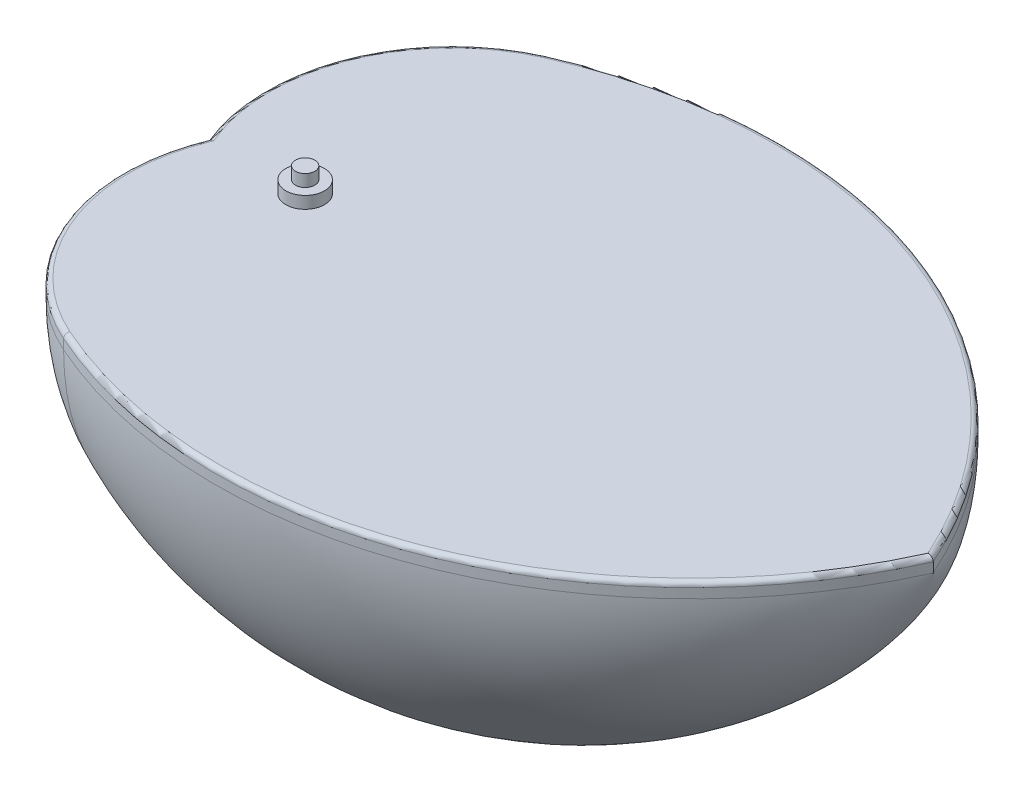
ISO-10303-21;
HEADER;
FILE_DESCRIPTION(('STEP AP214'),'2;1');
FILE_NAME('part.step','',(''),(''),'','','');
FILE_SCHEMA(('AUTOMOTIVE_DESIGN { 1 0 10303 214 1 1 1 1 }'));
ENDSEC;
DATA;
#1=APPLICATION_CONTEXT('core data for automotive mechanical design processes');
#2=APPLICATION_PROTOCOL_DEFINITION('international standard','automotive_design',2000,#1);
#3=PRODUCT_CONTEXT('',#1,'mechanical');
#4=PRODUCT('Part','Part','',(#3));
#5=PRODUCT_RELATED_PRODUCT_CATEGORY('part','',(#4));
#6=PRODUCT_DEFINITION_FORMATION('','',#4);
#7=PRODUCT_DEFINITION_CONTEXT('part definition',#1,'design');
#8=PRODUCT_DEFINITION('design','',#6,#7);
#9=PRODUCT_DEFINITION_SHAPE('','',#8);
#10=(LENGTH_UNIT() NAMED_UNIT(*) SI_UNIT(.MILLI.,.METRE.));
#11=(NAMED_UNIT(*) PLANE_ANGLE_UNIT() SI_UNIT($,.RADIAN.));
#12=(NAMED_UNIT(*) SI_UNIT($,.STERADIAN.) SOLID_ANGLE_UNIT());
#13=UNCERTAINTY_MEASURE_WITH_UNIT(LENGTH_MEASURE(1.E-05),#10,'distance_accuracy_value','');
#14=(GEOMETRIC_REPRESENTATION_CONTEXT(3) GLOBAL_UNCERTAINTY_ASSIGNED_CONTEXT((#13)) GLOBAL_UNIT_ASSIGNED_CONTEXT((#10,
#11,#12)) REPRESENTATION_CONTEXT('',''));
#15=CARTESIAN_POINT('',(0.,0.,0.));
#16=DIRECTION('',(0.,0.,1.));
#17=DIRECTION('',(1.,0.,0.));
#18=AXIS2_PLACEMENT_3D('',#15,#16,#17);
#19=CARTESIAN_POINT('',(15.6756756756759,53.,-14.7297297297297));
#20=DIRECTION('',(0.,-1.,0.));
#21=DIRECTION('',(0.,0.,-1.));
#22=AXIS2_PLACEMENT_3D('',#19,#20,#21);
#23=CYLINDRICAL_SURFACE('',#22,38.5968751692011);
#24=DIRECTION('',(0.,-1.,0.));
#25=VECTOR('',#24,1.);
#26=CARTESIAN_POINT('',(-20.,53.,0.));
#27=LINE('',#26,#25);
#28=CARTESIAN_POINT('',(-20.,52.,0.));
#29=VERTEX_POINT('',#28);
#30=CARTESIAN_POINT('',(-20.,50.,0.));
#31=VERTEX_POINT('',#30);
#32=EDGE_CURVE('E113',#29,#31,#27,.T.);
#33=ORIENTED_EDGE('',*,*,#32,.F.);
#34=CARTESIAN_POINT('',(15.6756756756759,52.,-14.7297297297297));
#35=DIRECTION('',(0.,1.,0.));
#36=DIRECTION('',(0.,0.,1.));
#37=AXIS2_PLACEMENT_3D('',#34,#35,#36);
#38=CIRCLE('',#37,38.5968751692011);
#39=CARTESIAN_POINT('',(0.,51.9999999999998,-50.));
#40=VERTEX_POINT('',#39);
#41=EDGE_CURVE('E57',#29,#40,#38,.F.);
#42=ORIENTED_EDGE('',*,*,#41,.T.);
#43=DIRECTION('',(0.,-1.,0.));
#44=VECTOR('',#43,1.);
#45=CARTESIAN_POINT('',(0.,52.9999999999998,-50.));
#46=LINE('',#45,#44);
#47=CARTESIAN_POINT('',(0.,49.9999999999998,-50.));
#48=VERTEX_POINT('',#47);
#49=EDGE_CURVE('E128',#40,#48,#46,.T.);
#50=ORIENTED_EDGE('',*,*,#49,.T.);
#51=CARTESIAN_POINT('',(15.6756756756759,50.,-14.7297297297296));
#52=DIRECTION('',(0.,-1.,0.));
#53=DIRECTION('',(1.,0.,0.));
#54=AXIS2_PLACEMENT_3D('',#51,#52,#53);
#55=CIRCLE('',#54,38.5968751692011);
#56=EDGE_CURVE('E126',#31,#48,#55,.T.);
#57=ORIENTED_EDGE('',*,*,#56,.F.);
#58=EDGE_LOOP('',(#33,#42,#50,#57));
#59=FACE_BOUND('',#58,.T.);
#60=ADVANCED_FACE('F46',(#59),#23,.T.);
#61=CARTESIAN_POINT('',(15.6756756756759,53.0000000000001,14.7297297297296));
#62=DIRECTION('',(0.,-1.,0.));
#63=DIRECTION('',(0.,0.,-1.));
#64=AXIS2_PLACEMENT_3D('',#61,#62,#63);
#65=CYLINDRICAL_SURFACE('',#64,38.5968751692011);
#66=DIRECTION('',(0.,-1.,0.));
#67=VECTOR('',#66,1.);
#68=CARTESIAN_POINT('',(0.,53.0000000000002,50.));
#69=LINE('',#68,#67);
#70=CARTESIAN_POINT('',(0.,52.0000000000002,50.));
#71=VERTEX_POINT('',#70);
#72=CARTESIAN_POINT('',(0.,50.0000000000002,50.));
#73=VERTEX_POINT('',#72);
#74=EDGE_CURVE('E123',#71,#73,#69,.T.);
#75=ORIENTED_EDGE('',*,*,#74,.F.);
#76=CARTESIAN_POINT('',(15.6756756756759,52.,14.7297297297296));
#77=DIRECTION('',(0.,1.,0.));
#78=DIRECTION('',(0.,0.,1.));
#79=AXIS2_PLACEMENT_3D('',#76,#77,#78);
#80=CIRCLE('',#79,38.5968751692011);
#81=EDGE_CURVE('E64',#71,#29,#80,.F.);
#82=ORIENTED_EDGE('',*,*,#81,.T.);
#83=ORIENTED_EDGE('',*,*,#32,.T.);
#84=CARTESIAN_POINT('',(15.6756756756759,50.0000000000001,14.7297297297296));
#85=DIRECTION('',(0.,1.,0.));
#86=DIRECTION('',(1.,0.,0.));
#87=AXIS2_PLACEMENT_3D('',#84,#85,#86);
#88=CIRCLE('',#87,38.5968751692011);
#89=EDGE_CURVE('E117',#31,#73,#88,.T.);
#90=ORIENTED_EDGE('',*,*,#89,.T.);
#91=EDGE_LOOP('',(#75,#82,#83,#90));
#92=FACE_BOUND('',#91,.T.);
#93=ADVANCED_FACE('F115',(#92),#65,.T.);
#94=CARTESIAN_POINT('',(40.0000000000002,52.9999999999999,-39.9999999999995));
#95=DIRECTION('',(0.,-1.,0.));
#96=DIRECTION('',(0.,0.,-1.));
#97=AXIS2_PLACEMENT_3D('',#94,#95,#96);
#98=CYLINDRICAL_SURFACE('',#97,98.4885780179606);
#99=DIRECTION('',(0.,-1.,0.));
#100=VECTOR('',#99,1.);
#101=CARTESIAN_POINT('',(130.,53.,0.));
#102=LINE('',#101,#100);
#103=CARTESIAN_POINT('',(130.,52.,0.));
#104=VERTEX_POINT('',#103);
#105=CARTESIAN_POINT('',(130.,50.,0.));
#106=VERTEX_POINT('',#105);
#107=EDGE_CURVE('E259',#104,#106,#102,.T.);
#108=ORIENTED_EDGE('',*,*,#107,.F.);
#109=CARTESIAN_POINT('',(40.0000000000002,51.9999999999999,-39.9999999999995));
#110=DIRECTION('',(0.,1.,0.));
#111=DIRECTION('',(0.,0.,1.));
#112=AXIS2_PLACEMENT_3D('',#109,#110,#111);
#113=CIRCLE('',#112,98.4885780179606);
#114=EDGE_CURVE('E72',#104,#71,#113,.F.);
#115=ORIENTED_EDGE('',*,*,#114,.T.);
#116=ORIENTED_EDGE('',*,*,#74,.T.);
#117=CARTESIAN_POINT('',(40.0000000000002,49.9999999999999,-39.9999999999995));
#118=DIRECTION('',(0.,1.,0.));
#119=DIRECTION('',(1.,0.,0.));
#120=AXIS2_PLACEMENT_3D('',#117,#118,#119);
#121=CIRCLE('',#120,98.4885780179606);
#122=EDGE_CURVE('E132',#73,#106,#121,.T.);
#123=ORIENTED_EDGE('',*,*,#122,.T.);
#124=EDGE_LOOP('',(#108,#115,#116,#123));
#125=FACE_BOUND('',#124,.T.);
#126=ADVANCED_FACE('F220',(#125),#98,.T.);
#127=CARTESIAN_POINT('',(40.0000000000002,53.0000000000001,39.9999999999994));
#128=DIRECTION('',(0.,-1.,0.));
#129=DIRECTION('',(0.,0.,-1.));
#130=AXIS2_PLACEMENT_3D('',#127,#128,#129);
#131=CYLINDRICAL_SURFACE('',#130,98.4885780179606);
#132=ORIENTED_EDGE('',*,*,#49,.F.);
#133=CARTESIAN_POINT('',(40.0000000000002,52.0000000000001,39.9999999999994));
#134=DIRECTION('',(0.,1.,0.));
#135=DIRECTION('',(0.,0.,1.));
#136=AXIS2_PLACEMENT_3D('',#133,#134,#135);
#137=CIRCLE('',#136,98.4885780179606);
#138=EDGE_CURVE('E166',#40,#104,#137,.F.);
#139=ORIENTED_EDGE('',*,*,#138,.T.);
#140=ORIENTED_EDGE('',*,*,#107,.T.);
#141=CARTESIAN_POINT('',(40.0000000000002,49.9999999999999,39.9999999999995));
#142=DIRECTION('',(0.,-1.,0.));
#143=DIRECTION('',(1.,0.,0.));
#144=AXIS2_PLACEMENT_3D('',#141,#142,#143);
#145=CIRCLE('',#144,98.4885780179606);
#146=EDGE_CURVE('E122',#48,#106,#145,.T.);
#147=ORIENTED_EDGE('',*,*,#146,.F.);
#148=EDGE_LOOP('',(#132,#139,#140,#147));
#149=FACE_BOUND('',#148,.T.);
#150=ADVANCED_FACE('F298',(#149),#131,.T.);
#151=CARTESIAN_POINT('',(15.6756756756759,53.,0.));
#152=DIRECTION('',(0.,1.,0.));
#153=DIRECTION('',(0.,0.,1.));
#154=AXIS2_PLACEMENT_3D('',#151,#152,#153);
#155=PLANE('',#154);
#156=CARTESIAN_POINT('',(0.,53.,0.));
#157=DIRECTION('',(0.,1.,0.));
#158=DIRECTION('',(0.,0.,1.));
#159=AXIS2_PLACEMENT_3D('',#156,#157,#158);
#160=CIRCLE('',#159,4.);
#161=CARTESIAN_POINT('',(0.,53.,3.99999999999999));
#162=VERTEX_POINT('',#161);
#163=EDGE_CURVE('E11',#162,#162,#160,.T.);
#164=ORIENTED_EDGE('',*,*,#163,.F.);
#165=EDGE_LOOP('',(#164));
#166=FACE_BOUND('',#165,.T.);
#167=CARTESIAN_POINT('',(40.0000000000002,52.9999999999999,-39.9999999999995));
#168=DIRECTION('',(0.,1.,0.));
#169=DIRECTION('',(0.,0.,1.));
#170=AXIS2_PLACEMENT_3D('',#167,#168,#169);
#171=CIRCLE('',#170,97.4885780179606);
#172=CARTESIAN_POINT('',(0.40613846605344,53.0000000000002,49.0861884513797));
#173=VERTEX_POINT('',#172);
#174=CARTESIAN_POINT('',(128.904571558295,53.,0.));
#175=VERTEX_POINT('',#174);
#176=EDGE_CURVE('E159',#173,#175,#171,.T.);
#177=ORIENTED_EDGE('',*,*,#176,.T.);
#178=CARTESIAN_POINT('',(40.0000000000002,53.0000000000001,39.9999999999994));
#179=DIRECTION('',(0.,1.,0.));
#180=DIRECTION('',(0.,0.,1.));
#181=AXIS2_PLACEMENT_3D('',#178,#179,#180);
#182=CIRCLE('',#181,97.4885780179606);
#183=CARTESIAN_POINT('',(0.406138466053471,52.9999999999998,-49.0861884513798));
#184=VERTEX_POINT('',#183);
#185=EDGE_CURVE('E162',#175,#184,#182,.T.);
#186=ORIENTED_EDGE('',*,*,#185,.T.);
#187=CARTESIAN_POINT('',(15.6756756756759,53.,-14.7297297297297));
#188=DIRECTION('',(0.,1.,0.));
#189=DIRECTION('',(0.,0.,1.));
#190=AXIS2_PLACEMENT_3D('',#187,#188,#189);
#191=CIRCLE('',#190,37.5968751692011);
#192=CARTESIAN_POINT('',(-18.9156539399606,53.,0.));
#193=VERTEX_POINT('',#192);
#194=EDGE_CURVE('E153',#184,#193,#191,.T.);
#195=ORIENTED_EDGE('',*,*,#194,.T.);
#196=CARTESIAN_POINT('',(15.6756756756759,53.0000000000001,14.7297297297296));
#197=DIRECTION('',(0.,1.,0.));
#198=DIRECTION('',(0.,0.,1.));
#199=AXIS2_PLACEMENT_3D('',#196,#197,#198);
#200=CIRCLE('',#199,37.5968751692011);
#201=EDGE_CURVE('E156',#193,#173,#200,.T.);
#202=ORIENTED_EDGE('',*,*,#201,.T.);
#203=EDGE_LOOP('',(#177,#186,#195,#202));
#204=FACE_BOUND('',#203,.T.);
#205=ADVANCED_FACE('F225',(#166,#204),#155,.T.);
#206=CARTESIAN_POINT('',(40.0000000000002,50.,39.9999999999995));
#207=DIRECTION('',(0.,-1.,0.));
#208=DIRECTION('',(0.,0.,-1.));
#209=AXIS2_PLACEMENT_3D('',#206,#207,#208);
#210=CIRCLE('',#209,98.4885780179606);
#211=TRIMMED_CURVE('',#210,(PARAMETER_VALUE(-1.15257199721567)),
(PARAMETER_VALUE(1.15257199721567)),.T.,.PARAMETER.);
#212=CARTESIAN_POINT('',(40.0000000000002,50.,0.));
#213=DIRECTION('',(1.,0.,0.));
#214=AXIS1_PLACEMENT('',#212,#213);
#215=SURFACE_OF_REVOLUTION('',#211,#214);
#216=ORIENTED_EDGE('',*,*,#146,.T.);
#217=ORIENTED_EDGE('',*,*,#122,.F.);
#218=CARTESIAN_POINT('',(0.,50.,0.));
#219=DIRECTION('',(1.,0.,0.));
#220=DIRECTION('',(0.,0.,-1.));
#221=AXIS2_PLACEMENT_3D('',#218,#219,#220);
#222=CIRCLE('',#221,50.);
#223=EDGE_CURVE('E137',#73,#48,#222,.T.);
#224=ORIENTED_EDGE('',*,*,#223,.T.);
#225=EDGE_LOOP('',(#216,#217,#224));
#226=FACE_BOUND('',#225,.T.);
#227=ADVANCED_FACE('F212',(#226),#215,.T.);
#228=CARTESIAN_POINT('',(15.6756756756759,50.,-14.7297297297296));
#229=DIRECTION('',(0.,-1.,0.));
#230=DIRECTION('',(0.,0.,-1.));
#231=AXIS2_PLACEMENT_3D('',#228,#229,#230);
#232=CIRCLE('',#231,38.5968751692011);
#233=TRIMMED_CURVE('',#232,(PARAMETER_VALUE(-1.96235556978583)),
(PARAMETER_VALUE(1.96235556978583)),.T.,.PARAMETER.);
#234=CARTESIAN_POINT('',(15.6756756756759,50.,0.));
#235=DIRECTION('',(1.,0.,0.));
#236=AXIS1_PLACEMENT('',#234,#235);
#237=SURFACE_OF_REVOLUTION('',#233,#236);
#238=ORIENTED_EDGE('',*,*,#89,.F.);
#239=ORIENTED_EDGE('',*,*,#56,.T.);
#240=ORIENTED_EDGE('',*,*,#223,.F.);
#241=EDGE_LOOP('',(#238,#239,#240));
#242=FACE_BOUND('',#241,.T.);
#243=ADVANCED_FACE('F135',(#242),#237,.T.);
#244=CARTESIAN_POINT('',(15.6756756756759,52.,14.7297297297296));
#245=DIRECTION('',(0.,1.,0.));
#246=DIRECTION('',(0.,0.,1.));
#247=AXIS2_PLACEMENT_3D('',#244,#245,#246);
#248=TOROIDAL_SURFACE('',#247,37.5968751692011,1.);
#249=CARTESIAN_POINT('',(-20.,52.,0.));
#250=CARTESIAN_POINT('',(-20.0000008942307,52.0265881981247,0.));
#251=CARTESIAN_POINT('',(-19.998851965732,52.0531630822867,0.));
#252=CARTESIAN_POINT('',(-19.9942757382792,52.106110709804,0.));
#253=CARTESIAN_POINT('',(-19.9908488928273,52.1324834923382,0.));
#254=CARTESIAN_POINT('',(-19.9772154187964,52.2108632711494,0.));
#255=CARTESIAN_POINT('',(-19.9636554984264,52.262325128727,0.));
#256=CARTESIAN_POINT('',(-19.9281336407968,52.3622047132036,0.));
#257=CARTESIAN_POINT('',(-19.9061738176468,52.4106232024982,0.));
#258=CARTESIAN_POINT('',(-19.8546681654547,52.5032534888218,0.));
#259=CARTESIAN_POINT('',(-19.825119583024,52.5474637510059,0.));
#260=CARTESIAN_POINT('',(-19.7584372603466,52.6319442369395,0.));
#261=CARTESIAN_POINT('',(-19.7210994483899,52.6720529195404,0.));
#262=CARTESIAN_POINT('',(-19.6406226546427,52.7459466810388,0.));
#263=CARTESIAN_POINT('',(-19.5974818451155,52.7797297595454,0.));
#264=CARTESIAN_POINT('',(-19.5033461416204,52.8425915319424,0.));
#265=CARTESIAN_POINT('',(-19.4520097056505,52.8711581761005,-1.77432944310521E-13));
#266=CARTESIAN_POINT('',(-19.3455037489036,52.9199489392985,1.79817796800386E-13));
#267=CARTESIAN_POINT('',(-19.29033278428,52.9401698957656,6.7599294229863E-13));
#268=CARTESIAN_POINT('',(-19.183406855448,52.970371105158,-5.80318881900574E-13));
#269=CARTESIAN_POINT('',(-19.1318852462507,52.9811915456213,-2.10648612234231E-12));
#270=CARTESIAN_POINT('',(-19.0279282565205,52.995821857923,2.1830662159427E-12));
#271=CARTESIAN_POINT('',(-18.9754949206272,52.9996457760884,7.98403603179329E-12));
#272=CARTESIAN_POINT('',(-18.9206196880964,52.9999921897505,7.33969878101688E-13));
#273=CARTESIAN_POINT('',(-18.9181367386374,53.0000000184385,3.77335158569541E-13));
#274=CARTESIAN_POINT('',(-18.9156539399606,53.,0.));
#275=B_SPLINE_CURVE_WITH_KNOTS('',3,(#249,#250,#251,#252,#253,#254,#255,#256,#257,#258,#259,
#260,#261,#262,#263,#264,#265,#266,#267,#268,#269,#270,#271,#272,#273,#274),.UNSPECIFIED.,.F.,
.F.,(4,2,2,2,2,2,2,2,2,2,2,2,4),(0.,0.079713634625249,0.159411404101059,0.31823432499261,
0.47701729918759,0.635857965340239,0.799549095224154,0.963291903213032,1.13879341601281,
1.31436137364606,1.47184816658384,1.62901843819876,1.6364672652337),.UNSPECIFIED.);
#276=EDGE_CURVE('E189',#29,#193,#275,.T.);
#277=ORIENTED_EDGE('',*,*,#276,.F.);
#278=ORIENTED_EDGE('',*,*,#81,.F.);
#279=CARTESIAN_POINT('',(0.406138466053441,52.0000000000002,49.0861884513797));
#280=DIRECTION('',(0.913811548620255,0.,0.406138466053452));
#281=DIRECTION('',(0.406138466053452,0.,-0.913811548620255));
#282=AXIS2_PLACEMENT_3D('',#279,#280,#281);
#283=CIRCLE('',#282,1.);
#284=EDGE_CURVE('E264',#173,#71,#283,.T.);
#285=ORIENTED_EDGE('',*,*,#284,.F.);
#286=ORIENTED_EDGE('',*,*,#201,.F.);
#287=EDGE_LOOP('',(#277,#278,#285,#286));
#288=FACE_BOUND('',#287,.T.);
#289=ADVANCED_FACE('F202',(#288),#248,.T.);
#290=CARTESIAN_POINT('',(40.0000000000002,51.9999999999999,-39.9999999999995));
#291=DIRECTION('',(0.,1.,0.));
#292=DIRECTION('',(0.,0.,1.));
#293=AXIS2_PLACEMENT_3D('',#290,#291,#292);
#294=TOROIDAL_SURFACE('',#293,97.4885780179606,1.);
#295=ORIENTED_EDGE('',*,*,#284,.T.);
#296=ORIENTED_EDGE('',*,*,#114,.F.);
#297=CARTESIAN_POINT('',(130.,52.,0.));
#298=CARTESIAN_POINT('',(130.000001063704,52.0263846918935,0.));
#299=CARTESIAN_POINT('',(129.99885646564,52.0527560680167,0.));
#300=CARTESIAN_POINT('',(129.994298653511,52.1052962087965,0.));
#301=CARTESIAN_POINT('',(129.990885946555,52.1314650174209,0.));
#302=CARTESIAN_POINT('',(129.97731413261,52.2092198167741,0.));
#303=CARTESIAN_POINT('',(129.963820924888,52.260261519649,0.));
#304=CARTESIAN_POINT('',(129.92850629502,52.3593116689709,0.));
#305=CARTESIAN_POINT('',(129.906687924555,52.4073212193799,0.));
#306=CARTESIAN_POINT('',(129.855560352759,52.4991855794193,0.));
#307=CARTESIAN_POINT('',(129.826247763203,52.5430384974611,0.));
#308=CARTESIAN_POINT('',(129.760017097683,52.6270609056992,0.));
#309=CARTESIAN_POINT('',(129.722870020557,52.6670493119072,0.));
#310=CARTESIAN_POINT('',(129.642844634507,52.7407976054189,0.));
#311=CARTESIAN_POINT('',(129.599964549754,52.7745555550636,0.));
#312=CARTESIAN_POINT('',(129.505981531127,52.8378109221036,0.));
#313=CARTESIAN_POINT('',(129.454492997587,52.8667348209543,0.));
#314=CARTESIAN_POINT('',(129.347654129277,52.916290104051,0.));
#315=CARTESIAN_POINT('',(129.292301878585,52.936917339411,2.00608339665692E-13));
#316=CARTESIAN_POINT('',(129.18312462043,52.9684918957236,-2.00332783021954E-13));
#317=CARTESIAN_POINT('',(129.129464030907,52.9800158452121,-7.04690371634336E-13));
#318=CARTESIAN_POINT('',(129.021146233815,52.9955849389944,7.43338316809106E-13));
#319=CARTESIAN_POINT('',(128.966491296369,52.9996453758491,2.69068727056526E-12));
#320=CARTESIAN_POINT('',(128.909445447529,52.9999926077209,2.24154963855339E-13));
#321=CARTESIAN_POINT('',(128.907008430336,53.0000000169733,1.10198637629473E-13));
#322=CARTESIAN_POINT('',(128.904571558295,53.,0.));
#323=B_SPLINE_CURVE_WITH_KNOTS('',3,(#297,#298,#299,#300,#301,#302,#303,#304,#305,#306,#307,
#308,#309,#310,#311,#312,#313,#314,#315,#316,#317,#318,#319,#320,#321,#322),.UNSPECIFIED.,.F.,
.F.,(4,2,2,2,2,2,2,2,2,2,2,2,4),(0.,0.0791031570853779,0.15818863400455,0.315745849009953,
0.473245365069512,0.630816214870673,0.793865688202623,0.956965784446389,1.13339286779325,
1.30990806710712,1.47406439610279,1.63788399611204,1.64519502833842),.UNSPECIFIED.);
#324=EDGE_CURVE('E179',#175,#104,#323,.F.);
#325=ORIENTED_EDGE('',*,*,#324,.F.);
#326=ORIENTED_EDGE('',*,*,#176,.F.);
#327=EDGE_LOOP('',(#295,#296,#325,#326));
#328=FACE_BOUND('',#327,.T.);
#329=ADVANCED_FACE('F194',(#328),#294,.T.);
#330=CARTESIAN_POINT('',(15.6756756756759,52.,-14.7297297297297));
#331=DIRECTION('',(0.,1.,0.));
#332=DIRECTION('',(0.,0.,1.));
#333=AXIS2_PLACEMENT_3D('',#330,#331,#332);
#334=TOROIDAL_SURFACE('',#333,37.5968751692011,1.);
#335=ORIENTED_EDGE('',*,*,#276,.T.);
#336=ORIENTED_EDGE('',*,*,#194,.F.);
#337=CARTESIAN_POINT('',(0.406138466053471,51.9999999999998,-49.0861884513798));
#338=DIRECTION('',(0.913811548620255,0.,-0.406138466053452));
#339=DIRECTION('',(-0.406138466053452,0.,-0.913811548620255));
#340=AXIS2_PLACEMENT_3D('',#337,#338,#339);
#341=CIRCLE('',#340,1.);
#342=EDGE_CURVE('E176',#40,#184,#341,.T.);
#343=ORIENTED_EDGE('',*,*,#342,.F.);
#344=ORIENTED_EDGE('',*,*,#41,.F.);
#345=EDGE_LOOP('',(#335,#336,#343,#344));
#346=FACE_BOUND('',#345,.T.);
#347=ADVANCED_FACE('F48',(#346),#334,.T.);
#348=CARTESIAN_POINT('',(40.0000000000002,52.0000000000001,39.9999999999994));
#349=DIRECTION('',(0.,1.,0.));
#350=DIRECTION('',(0.,0.,1.));
#351=AXIS2_PLACEMENT_3D('',#348,#349,#350);
#352=TOROIDAL_SURFACE('',#351,97.4885780179606,1.);
#353=ORIENTED_EDGE('',*,*,#324,.T.);
#354=ORIENTED_EDGE('',*,*,#138,.F.);
#355=ORIENTED_EDGE('',*,*,#342,.T.);
#356=ORIENTED_EDGE('',*,*,#185,.F.);
#357=EDGE_LOOP('',(#353,#354,#355,#356));
#358=FACE_BOUND('',#357,.T.);
#359=ADVANCED_FACE('F197',(#358),#352,.T.);
#360=CARTESIAN_POINT('',(0.,57.9999999999998,0.));
#361=DIRECTION('',(0.,1.,0.));
#362=DIRECTION('',(0.,0.,1.));
#363=AXIS2_PLACEMENT_3D('',#360,#361,#362);
#364=PLANE('',#363);
#365=CARTESIAN_POINT('',(0.,57.9999999999998,0.));
#366=DIRECTION('',(0.,-1.,0.));
#367=DIRECTION('',(0.,0.,-1.));
#368=AXIS2_PLACEMENT_3D('',#365,#366,#367);
#369=CIRCLE('',#368,2.);
#370=CARTESIAN_POINT('',(0.,57.9999999999998,-2.));
#371=VERTEX_POINT('',#370);
#372=EDGE_CURVE('E180',#371,#371,#369,.T.);
#373=ORIENTED_EDGE('',*,*,#372,.F.);
#374=EDGE_LOOP('',(#373));
#375=FACE_BOUND('',#374,.T.);
#376=ADVANCED_FACE('F200',(#375),#364,.T.);
#377=CARTESIAN_POINT('',(0.,53.,0.));
#378=DIRECTION('',(0.,-1.,0.));
#379=DIRECTION('',(0.,0.,-1.));
#380=AXIS2_PLACEMENT_3D('',#377,#378,#379);
#381=CYLINDRICAL_SURFACE('',#380,2.);
#382=ORIENTED_EDGE('',*,*,#372,.T.);
#383=EDGE_LOOP('',(#382));
#384=FACE_BOUND('',#383,.T.);
#385=CARTESIAN_POINT('',(0.,55.4999999999998,0.));
#386=DIRECTION('',(0.,-1.,0.));
#387=DIRECTION('',(0.,0.,-1.));
#388=AXIS2_PLACEMENT_3D('',#385,#386,#387);
#389=CIRCLE('',#388,2.);
#390=CARTESIAN_POINT('',(0.,55.4999999999998,-2.));
#391=VERTEX_POINT('',#390);
#392=EDGE_CURVE('E268',#391,#391,#389,.T.);
#393=ORIENTED_EDGE('',*,*,#392,.F.);
#394=EDGE_LOOP('',(#393));
#395=FACE_BOUND('',#394,.T.);
#396=ADVANCED_FACE('F282',(#384,#395),#381,.T.);
#397=CARTESIAN_POINT('',(0.,55.4999999999998,-2.));
#398=DIRECTION('',(0.,1.,0.));
#399=DIRECTION('',(0.,0.,1.));
#400=AXIS2_PLACEMENT_3D('',#397,#398,#399);
#401=PLANE('',#400);
#402=ORIENTED_EDGE('',*,*,#392,.T.);
#403=EDGE_LOOP('',(#402));
#404=FACE_BOUND('',#403,.T.);
#405=CARTESIAN_POINT('',(0.,55.4999999999998,0.));
#406=DIRECTION('',(0.,-1.,0.));
#407=DIRECTION('',(0.,0.,-1.));
#408=AXIS2_PLACEMENT_3D('',#405,#406,#407);
#409=CIRCLE('',#408,4.);
#410=CARTESIAN_POINT('',(0.,55.4999999999998,-4.));
#411=VERTEX_POINT('',#410);
#412=EDGE_CURVE('E272',#411,#411,#409,.T.);
#413=ORIENTED_EDGE('',*,*,#412,.F.);
#414=EDGE_LOOP('',(#413));
#415=FACE_BOUND('',#414,.T.);
#416=ADVANCED_FACE('F280',(#404,#415),#401,.T.);
#417=CARTESIAN_POINT('',(0.,53.,0.));
#418=DIRECTION('',(0.,-1.,0.));
#419=DIRECTION('',(0.,0.,-1.));
#420=AXIS2_PLACEMENT_3D('',#417,#418,#419);
#421=CYLINDRICAL_SURFACE('',#420,4.);
#422=ORIENTED_EDGE('',*,*,#412,.T.);
#423=EDGE_LOOP('',(#422));
#424=FACE_BOUND('',#423,.T.);
#425=ORIENTED_EDGE('',*,*,#163,.T.);
#426=EDGE_LOOP('',(#425));
#427=FACE_BOUND('',#426,.T.);
#428=ADVANCED_FACE('F277',(#424,#427),#421,.T.);
#429=CLOSED_SHELL('',(#60,#93,#126,#150,#205,#227,#243,#289,#329,#347,#359,#376,#396,#416,#428));
#430=CARTESIAN_POINT('',(40.0000000000002,50.,39.9999999999995));
#431=DIRECTION('',(0.,-1.,0.));
#432=DIRECTION('',(0.,0.,-1.));
#433=AXIS2_PLACEMENT_3D('',#430,#431,#432);
#434=CIRCLE('',#433,95.7548954362121);
#435=TRIMMED_CURVE('',#434,(PARAMETER_VALUE(-1.13984733939452)),
(PARAMETER_VALUE(1.13984733939452)),.T.,.PARAMETER.);
#436=CARTESIAN_POINT('',(40.0000000000002,50.,0.));
#437=DIRECTION('',(1.,0.,0.));
#438=AXIS1_PLACEMENT('',#436,#437);
#439=SURFACE_OF_REVOLUTION('',#435,#438);
#440=CARTESIAN_POINT('',(0.,50.,0.));
#441=DIRECTION('',(1.,0.,0.));
#442=DIRECTION('',(0.,0.,-1.));
#443=AXIS2_PLACEMENT_3D('',#440,#441,#442);
#444=CIRCLE('',#443,47.);
#445=CARTESIAN_POINT('',(0.,50.0000000000002,47.));
#446=VERTEX_POINT('',#445);
#447=CARTESIAN_POINT('',(0.,49.9999999999998,-47.));
#448=VERTEX_POINT('',#447);
#449=EDGE_CURVE('E144',#446,#448,#444,.T.);
#450=ORIENTED_EDGE('',*,*,#449,.F.);
#451=CARTESIAN_POINT('',(40.0000000000002,49.9999999999999,-39.9999999999995));
#452=DIRECTION('',(0.,-1.,0.));
#453=DIRECTION('',(1.,0.,0.));
#454=AXIS2_PLACEMENT_3D('',#451,#452,#453);
#455=CIRCLE('',#454,95.7548954362121);
#456=CARTESIAN_POINT('',(127.,50.,0.));
#457=VERTEX_POINT('',#456);
#458=EDGE_CURVE('E146',#457,#446,#455,.T.);
#459=ORIENTED_EDGE('',*,*,#458,.F.);
#460=CARTESIAN_POINT('',(40.0000000000002,49.9999999999999,39.9999999999995));
#461=DIRECTION('',(0.,1.,0.));
#462=DIRECTION('',(1.,0.,0.));
#463=AXIS2_PLACEMENT_3D('',#460,#461,#462);
#464=CIRCLE('',#463,95.7548954362121);
#465=EDGE_CURVE('E242',#457,#448,#464,.T.);
#466=ORIENTED_EDGE('',*,*,#465,.T.);
#467=EDGE_LOOP('',(#450,#459,#466));
#468=FACE_BOUND('',#467,.T.);
#469=ADVANCED_FACE('F231',(#468),#439,.F.);
#470=CARTESIAN_POINT('',(14.6553241419773,50.,-15.1246699911997));
#471=DIRECTION('',(0.,-1.,0.));
#472=DIRECTION('',(0.,0.,-1.));
#473=AXIS2_PLACEMENT_3D('',#470,#471,#472);
#474=CIRCLE('',#473,35.0829757699706);
#475=TRIMMED_CURVE('',#474,(PARAMETER_VALUE(-2.01652045911043)),
(PARAMETER_VALUE(2.01652045911043)),.T.,.PARAMETER.);
#476=CARTESIAN_POINT('',(14.6553241419773,50.,0.));
#477=DIRECTION('',(1.,0.,0.));
#478=AXIS1_PLACEMENT('',#476,#477);
#479=SURFACE_OF_REVOLUTION('',#475,#478);
#480=CARTESIAN_POINT('',(14.6553241419773,50.,-15.1246699911997));
#481=DIRECTION('',(0.,1.,0.));
#482=DIRECTION('',(1.,0.,0.));
#483=AXIS2_PLACEMENT_3D('',#480,#481,#482);
#484=CIRCLE('',#483,35.0829757699706);
#485=CARTESIAN_POINT('',(-17.,50.,0.));
#486=VERTEX_POINT('',#485);
#487=EDGE_CURVE('E133',#448,#486,#484,.T.);
#488=ORIENTED_EDGE('',*,*,#487,.T.);
#489=CARTESIAN_POINT('',(14.6553241419773,50.0000000000001,15.1246699911997));
#490=DIRECTION('',(0.,-1.,0.));
#491=DIRECTION('',(1.,0.,0.));
#492=AXIS2_PLACEMENT_3D('',#489,#490,#491);
#493=CIRCLE('',#492,35.0829757699706);
#494=EDGE_CURVE('E140',#446,#486,#493,.T.);
#495=ORIENTED_EDGE('',*,*,#494,.F.);
#496=ORIENTED_EDGE('',*,*,#449,.T.);
#497=EDGE_LOOP('',(#488,#495,#496));
#498=FACE_BOUND('',#497,.T.);
#499=ADVANCED_FACE('F228',(#498),#479,.F.);
#500=CARTESIAN_POINT('',(15.6756756756759,50.,0.));
#501=DIRECTION('',(0.,1.,0.));
#502=DIRECTION('',(0.,0.,1.));
#503=AXIS2_PLACEMENT_3D('',#500,#501,#502);
#504=PLANE('',#503);
#505=ORIENTED_EDGE('',*,*,#465,.F.);
#506=ORIENTED_EDGE('',*,*,#458,.T.);
#507=ORIENTED_EDGE('',*,*,#494,.T.);
#508=ORIENTED_EDGE('',*,*,#487,.F.);
#509=EDGE_LOOP('',(#505,#506,#507,#508));
#510=FACE_BOUND('',#509,.T.);
#511=ADVANCED_FACE('F230',(#510),#504,.F.);
#512=CLOSED_SHELL('',(#469,#499,#511));
#513=ORIENTED_CLOSED_SHELL('',*,#512,.T.);
#514=BREP_WITH_VOIDS('B2',#429,(#513));
#515=ADVANCED_BREP_SHAPE_REPRESENTATION('',(#18,#514),#14);
#516=SHAPE_DEFINITION_REPRESENTATION(#9,#515);
ENDSEC;
END-ISO-10303-21;
